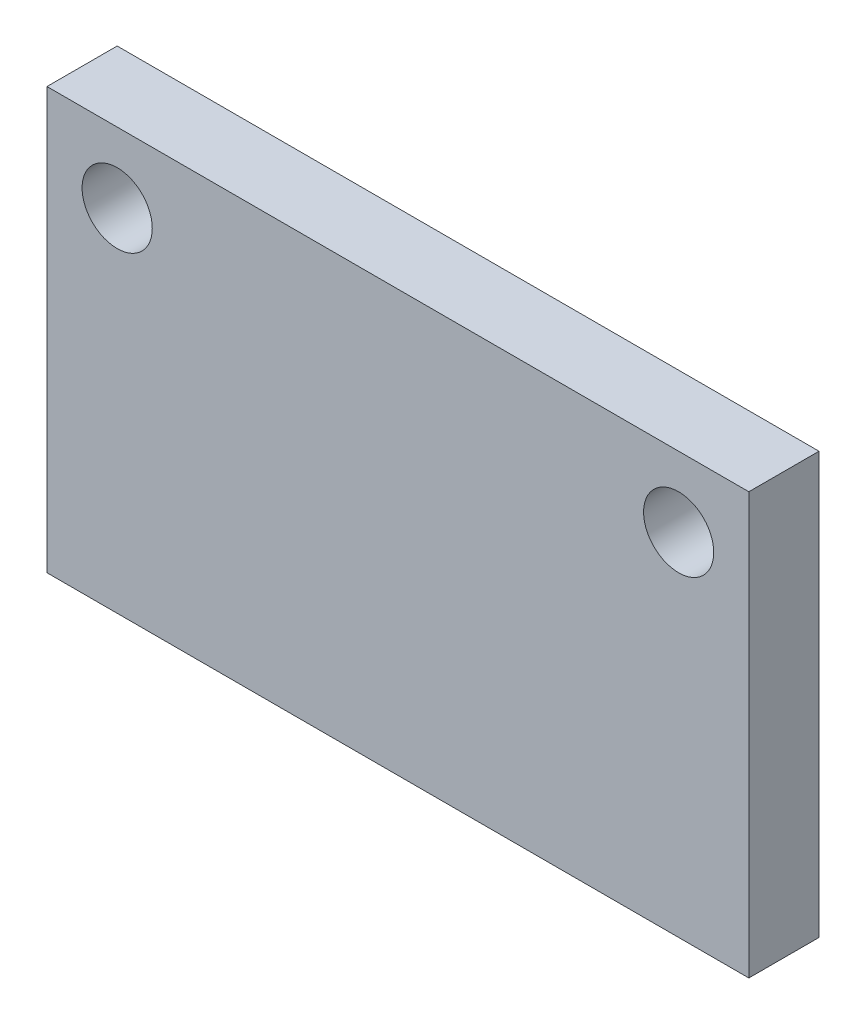
ISO-10303-21;
HEADER;
FILE_DESCRIPTION(('STEP AP214'),'2;1');
FILE_NAME('part.step','',(''),(''),'','','');
FILE_SCHEMA(('AUTOMOTIVE_DESIGN { 1 0 10303 214 1 1 1 1 }'));
ENDSEC;
DATA;
#1=APPLICATION_CONTEXT('core data for automotive mechanical design processes');
#2=APPLICATION_PROTOCOL_DEFINITION('international standard','automotive_design',2000,#1);
#3=PRODUCT_CONTEXT('',#1,'mechanical');
#4=PRODUCT('Part','Part','',(#3));
#5=PRODUCT_RELATED_PRODUCT_CATEGORY('part','',(#4));
#6=PRODUCT_DEFINITION_FORMATION('','',#4);
#7=PRODUCT_DEFINITION_CONTEXT('part definition',#1,'design');
#8=PRODUCT_DEFINITION('design','',#6,#7);
#9=PRODUCT_DEFINITION_SHAPE('','',#8);
#10=(LENGTH_UNIT() NAMED_UNIT(*) SI_UNIT(.MILLI.,.METRE.));
#11=(NAMED_UNIT(*) PLANE_ANGLE_UNIT() SI_UNIT($,.RADIAN.));
#12=(NAMED_UNIT(*) SI_UNIT($,.STERADIAN.) SOLID_ANGLE_UNIT());
#13=UNCERTAINTY_MEASURE_WITH_UNIT(LENGTH_MEASURE(1.E-05),#10,'distance_accuracy_value','');
#14=(GEOMETRIC_REPRESENTATION_CONTEXT(3) GLOBAL_UNCERTAINTY_ASSIGNED_CONTEXT((#13)) GLOBAL_UNIT_ASSIGNED_CONTEXT((#10,
#11,#12)) REPRESENTATION_CONTEXT('',''));
#15=CARTESIAN_POINT('',(0.,0.,0.));
#16=DIRECTION('',(0.,0.,1.));
#17=DIRECTION('',(1.,0.,0.));
#18=AXIS2_PLACEMENT_3D('',#15,#16,#17);
#19=CARTESIAN_POINT('',(0.,0.,2.54));
#20=DIRECTION('',(0.,0.,-1.));
#21=DIRECTION('',(-1.,0.,0.));
#22=AXIS2_PLACEMENT_3D('',#19,#20,#21);
#23=PLANE('',#22);
#24=DIRECTION('',(0.,1.,0.));
#25=VECTOR('',#24,1.);
#26=CARTESIAN_POINT('',(12.7,-7.62,2.54));
#27=LINE('',#26,#25);
#28=CARTESIAN_POINT('',(12.7,-7.62,2.54));
#29=VERTEX_POINT('',#28);
#30=CARTESIAN_POINT('',(12.7,7.62,2.54));
#31=VERTEX_POINT('',#30);
#32=EDGE_CURVE('E91',#29,#31,#27,.T.);
#33=ORIENTED_EDGE('',*,*,#32,.T.);
#34=DIRECTION('',(-1.,0.,0.));
#35=VECTOR('',#34,1.);
#36=CARTESIAN_POINT('',(-12.7,7.62,2.54));
#37=LINE('',#36,#35);
#38=CARTESIAN_POINT('',(-12.7,7.62,2.54));
#39=VERTEX_POINT('',#38);
#40=EDGE_CURVE('E86',#31,#39,#37,.T.);
#41=ORIENTED_EDGE('',*,*,#40,.T.);
#42=DIRECTION('',(0.,-1.,0.));
#43=VECTOR('',#42,1.);
#44=CARTESIAN_POINT('',(-12.7,-7.62,2.54));
#45=LINE('',#44,#43);
#46=CARTESIAN_POINT('',(-12.7,-7.62,2.54));
#47=VERTEX_POINT('',#46);
#48=EDGE_CURVE('E89',#39,#47,#45,.T.);
#49=ORIENTED_EDGE('',*,*,#48,.T.);
#50=DIRECTION('',(1.,0.,0.));
#51=VECTOR('',#50,1.);
#52=CARTESIAN_POINT('',(-12.7,-7.62,2.54));
#53=LINE('',#52,#51);
#54=EDGE_CURVE('E56',#47,#29,#53,.T.);
#55=ORIENTED_EDGE('',*,*,#54,.T.);
#56=EDGE_LOOP('',(#33,#41,#49,#55));
#57=FACE_BOUND('',#56,.T.);
#58=CARTESIAN_POINT('',(-10.16,5.08,2.54));
#59=DIRECTION('',(0.,0.,1.));
#60=DIRECTION('',(1.,0.,0.));
#61=AXIS2_PLACEMENT_3D('',#58,#59,#60);
#62=CIRCLE('',#61,1.27);
#63=CARTESIAN_POINT('',(-8.89,5.08,2.54));
#64=VERTEX_POINT('',#63);
#65=EDGE_CURVE('E106',#64,#64,#62,.T.);
#66=ORIENTED_EDGE('',*,*,#65,.F.);
#67=EDGE_LOOP('',(#66));
#68=FACE_BOUND('',#67,.T.);
#69=CARTESIAN_POINT('',(10.16,5.08,2.54));
#70=DIRECTION('',(0.,0.,1.));
#71=DIRECTION('',(-1.,0.,0.));
#72=AXIS2_PLACEMENT_3D('',#69,#70,#71);
#73=CIRCLE('',#72,1.27);
#74=CARTESIAN_POINT('',(8.89,5.08,2.54));
#75=VERTEX_POINT('',#74);
#76=EDGE_CURVE('E121',#75,#75,#73,.T.);
#77=ORIENTED_EDGE('',*,*,#76,.F.);
#78=EDGE_LOOP('',(#77));
#79=FACE_BOUND('',#78,.T.);
#80=ADVANCED_FACE('F39',(#57,#68,#79),#23,.F.);
#81=CARTESIAN_POINT('',(0.,0.,0.));
#82=DIRECTION('',(0.,0.,-1.));
#83=DIRECTION('',(-1.,0.,0.));
#84=AXIS2_PLACEMENT_3D('',#81,#82,#83);
#85=PLANE('',#84);
#86=CARTESIAN_POINT('',(-10.16,5.08,0.));
#87=DIRECTION('',(0.,0.,1.));
#88=DIRECTION('',(1.,0.,0.));
#89=AXIS2_PLACEMENT_3D('',#86,#87,#88);
#90=CIRCLE('',#89,1.27);
#91=CARTESIAN_POINT('',(-8.89,5.08,0.));
#92=VERTEX_POINT('',#91);
#93=EDGE_CURVE('E118',#92,#92,#90,.T.);
#94=ORIENTED_EDGE('',*,*,#93,.T.);
#95=EDGE_LOOP('',(#94));
#96=FACE_BOUND('',#95,.T.);
#97=DIRECTION('',(0.,1.,0.));
#98=VECTOR('',#97,1.);
#99=CARTESIAN_POINT('',(12.7,-7.62,0.));
#100=LINE('',#99,#98);
#101=CARTESIAN_POINT('',(12.7,-7.62,0.));
#102=VERTEX_POINT('',#101);
#103=CARTESIAN_POINT('',(12.7,7.62,0.));
#104=VERTEX_POINT('',#103);
#105=EDGE_CURVE('E103',#102,#104,#100,.T.);
#106=ORIENTED_EDGE('',*,*,#105,.F.);
#107=DIRECTION('',(1.,0.,0.));
#108=VECTOR('',#107,1.);
#109=CARTESIAN_POINT('',(-12.7,-7.62,0.));
#110=LINE('',#109,#108);
#111=CARTESIAN_POINT('',(-12.7,-7.62,0.));
#112=VERTEX_POINT('',#111);
#113=EDGE_CURVE('E79',#112,#102,#110,.T.);
#114=ORIENTED_EDGE('',*,*,#113,.F.);
#115=DIRECTION('',(0.,-1.,0.));
#116=VECTOR('',#115,1.);
#117=CARTESIAN_POINT('',(-12.7,-7.62,0.));
#118=LINE('',#117,#116);
#119=CARTESIAN_POINT('',(-12.7,7.62,0.));
#120=VERTEX_POINT('',#119);
#121=EDGE_CURVE('E73',#120,#112,#118,.T.);
#122=ORIENTED_EDGE('',*,*,#121,.F.);
#123=DIRECTION('',(-1.,0.,0.));
#124=VECTOR('',#123,1.);
#125=CARTESIAN_POINT('',(-12.7,7.62,0.));
#126=LINE('',#125,#124);
#127=EDGE_CURVE('E95',#104,#120,#126,.T.);
#128=ORIENTED_EDGE('',*,*,#127,.F.);
#129=EDGE_LOOP('',(#106,#114,#122,#128));
#130=FACE_BOUND('',#129,.T.);
#131=CARTESIAN_POINT('',(10.16,5.08,0.));
#132=DIRECTION('',(0.,0.,1.));
#133=DIRECTION('',(-1.,0.,0.));
#134=AXIS2_PLACEMENT_3D('',#131,#132,#133);
#135=CIRCLE('',#134,1.27);
#136=CARTESIAN_POINT('',(8.89,5.08,0.));
#137=VERTEX_POINT('',#136);
#138=EDGE_CURVE('E124',#137,#137,#135,.T.);
#139=ORIENTED_EDGE('',*,*,#138,.T.);
#140=EDGE_LOOP('',(#139));
#141=FACE_BOUND('',#140,.T.);
#142=ADVANCED_FACE('F114',(#96,#130,#141),#85,.T.);
#143=CARTESIAN_POINT('',(12.7,-7.62,2.54));
#144=DIRECTION('',(-1.,0.,0.));
#145=DIRECTION('',(0.,0.,1.));
#146=AXIS2_PLACEMENT_3D('',#143,#144,#145);
#147=PLANE('',#146);
#148=ORIENTED_EDGE('',*,*,#105,.T.);
#149=DIRECTION('',(0.,0.,-1.));
#150=VECTOR('',#149,1.);
#151=CARTESIAN_POINT('',(12.7,7.62,2.54));
#152=LINE('',#151,#150);
#153=EDGE_CURVE('E11',#31,#104,#152,.T.);
#154=ORIENTED_EDGE('',*,*,#153,.F.);
#155=ORIENTED_EDGE('',*,*,#32,.F.);
#156=DIRECTION('',(0.,0.,-1.));
#157=VECTOR('',#156,1.);
#158=CARTESIAN_POINT('',(12.7,-7.62,2.54));
#159=LINE('',#158,#157);
#160=EDGE_CURVE('E99',#29,#102,#159,.T.);
#161=ORIENTED_EDGE('',*,*,#160,.T.);
#162=EDGE_LOOP('',(#148,#154,#155,#161));
#163=FACE_BOUND('',#162,.T.);
#164=ADVANCED_FACE('F41',(#163),#147,.F.);
#165=CARTESIAN_POINT('',(-12.7,7.62,2.54));
#166=DIRECTION('',(0.,-1.,0.));
#167=DIRECTION('',(0.,0.,-1.));
#168=AXIS2_PLACEMENT_3D('',#165,#166,#167);
#169=PLANE('',#168);
#170=ORIENTED_EDGE('',*,*,#127,.T.);
#171=DIRECTION('',(0.,0.,-1.));
#172=VECTOR('',#171,1.);
#173=CARTESIAN_POINT('',(-12.7,7.62,2.54));
#174=LINE('',#173,#172);
#175=EDGE_CURVE('E48',#39,#120,#174,.T.);
#176=ORIENTED_EDGE('',*,*,#175,.F.);
#177=ORIENTED_EDGE('',*,*,#40,.F.);
#178=ORIENTED_EDGE('',*,*,#153,.T.);
#179=EDGE_LOOP('',(#170,#176,#177,#178));
#180=FACE_BOUND('',#179,.T.);
#181=ADVANCED_FACE('F94',(#180),#169,.F.);
#182=CARTESIAN_POINT('',(-12.7,-7.62,2.54));
#183=DIRECTION('',(1.,0.,0.));
#184=DIRECTION('',(0.,0.,-1.));
#185=AXIS2_PLACEMENT_3D('',#182,#183,#184);
#186=PLANE('',#185);
#187=ORIENTED_EDGE('',*,*,#121,.T.);
#188=DIRECTION('',(0.,0.,-1.));
#189=VECTOR('',#188,1.);
#190=CARTESIAN_POINT('',(-12.7,-7.62,2.54));
#191=LINE('',#190,#189);
#192=EDGE_CURVE('E96',#47,#112,#191,.T.);
#193=ORIENTED_EDGE('',*,*,#192,.F.);
#194=ORIENTED_EDGE('',*,*,#48,.F.);
#195=ORIENTED_EDGE('',*,*,#175,.T.);
#196=EDGE_LOOP('',(#187,#193,#194,#195));
#197=FACE_BOUND('',#196,.T.);
#198=ADVANCED_FACE('F97',(#197),#186,.F.);
#199=CARTESIAN_POINT('',(-12.7,-7.62,2.54));
#200=DIRECTION('',(0.,1.,0.));
#201=DIRECTION('',(0.,0.,1.));
#202=AXIS2_PLACEMENT_3D('',#199,#200,#201);
#203=PLANE('',#202);
#204=ORIENTED_EDGE('',*,*,#113,.T.);
#205=ORIENTED_EDGE('',*,*,#160,.F.);
#206=ORIENTED_EDGE('',*,*,#54,.F.);
#207=ORIENTED_EDGE('',*,*,#192,.T.);
#208=EDGE_LOOP('',(#204,#205,#206,#207));
#209=FACE_BOUND('',#208,.T.);
#210=ADVANCED_FACE('F111',(#209),#203,.F.);
#211=CARTESIAN_POINT('',(-10.16,5.08,2.54));
#212=DIRECTION('',(0.,0.,-1.));
#213=DIRECTION('',(-1.,0.,0.));
#214=AXIS2_PLACEMENT_3D('',#211,#212,#213);
#215=CYLINDRICAL_SURFACE('',#214,1.27);
#216=ORIENTED_EDGE('',*,*,#65,.T.);
#217=EDGE_LOOP('',(#216));
#218=FACE_BOUND('',#217,.T.);
#219=ORIENTED_EDGE('',*,*,#93,.F.);
#220=EDGE_LOOP('',(#219));
#221=FACE_BOUND('',#220,.T.);
#222=ADVANCED_FACE('F141',(#218,#221),#215,.F.);
#223=CARTESIAN_POINT('',(10.16,5.08,2.54));
#224=DIRECTION('',(0.,0.,-1.));
#225=DIRECTION('',(-1.,0.,0.));
#226=AXIS2_PLACEMENT_3D('',#223,#224,#225);
#227=CYLINDRICAL_SURFACE('',#226,1.27);
#228=ORIENTED_EDGE('',*,*,#76,.T.);
#229=EDGE_LOOP('',(#228));
#230=FACE_BOUND('',#229,.T.);
#231=ORIENTED_EDGE('',*,*,#138,.F.);
#232=EDGE_LOOP('',(#231));
#233=FACE_BOUND('',#232,.T.);
#234=ADVANCED_FACE('F130',(#230,#233),#227,.F.);
#235=CLOSED_SHELL('',(#80,#142,#164,#181,#198,#210,#222,#234));
#236=MANIFOLD_SOLID_BREP('B2',#235);
#237=ADVANCED_BREP_SHAPE_REPRESENTATION('',(#18,#236),#14);
#238=SHAPE_DEFINITION_REPRESENTATION(#9,#237);
ENDSEC;
END-ISO-10303-21;
